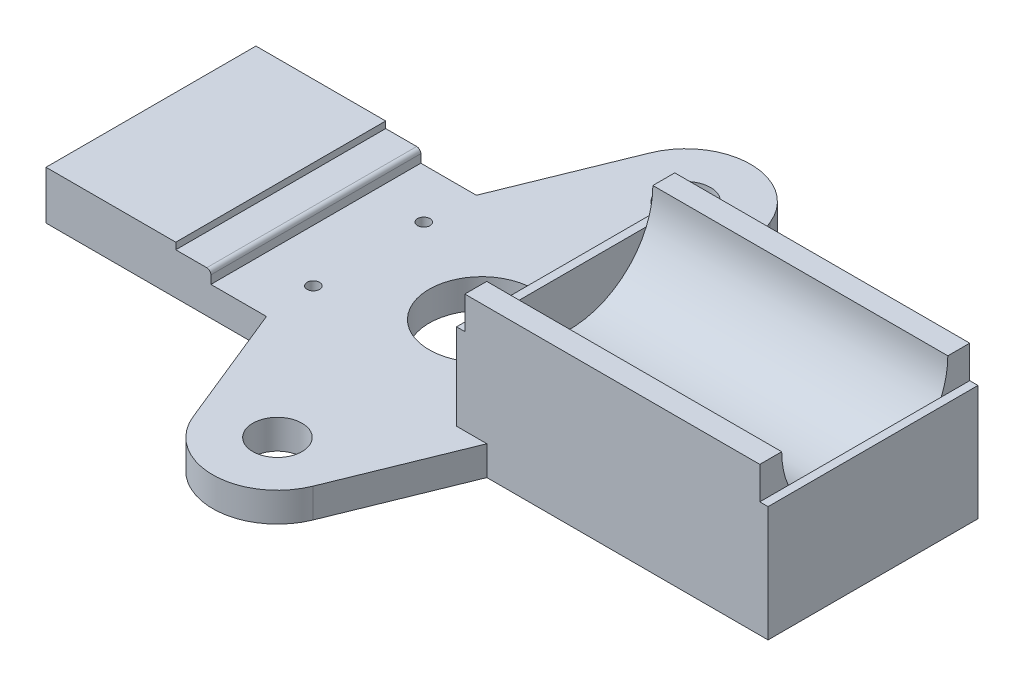
ISO-10303-21;
HEADER;
FILE_DESCRIPTION(('STEP AP214'),'2;1');
FILE_NAME('part.step','',(''),(''),'','','');
FILE_SCHEMA(('AUTOMOTIVE_DESIGN { 1 0 10303 214 1 1 1 1 }'));
ENDSEC;
DATA;
#1=APPLICATION_CONTEXT('core data for automotive mechanical design processes');
#2=APPLICATION_PROTOCOL_DEFINITION('international standard','automotive_design',2000,#1);
#3=PRODUCT_CONTEXT('',#1,'mechanical');
#4=PRODUCT('Part','Part','',(#3));
#5=PRODUCT_RELATED_PRODUCT_CATEGORY('part','',(#4));
#6=PRODUCT_DEFINITION_FORMATION('','',#4);
#7=PRODUCT_DEFINITION_CONTEXT('part definition',#1,'design');
#8=PRODUCT_DEFINITION('design','',#6,#7);
#9=PRODUCT_DEFINITION_SHAPE('','',#8);
#10=(LENGTH_UNIT() NAMED_UNIT(*) SI_UNIT(.MILLI.,.METRE.));
#11=(NAMED_UNIT(*) PLANE_ANGLE_UNIT() SI_UNIT($,.RADIAN.));
#12=(NAMED_UNIT(*) SI_UNIT($,.STERADIAN.) SOLID_ANGLE_UNIT());
#13=UNCERTAINTY_MEASURE_WITH_UNIT(LENGTH_MEASURE(1.E-05),#10,'distance_accuracy_value','');
#14=(GEOMETRIC_REPRESENTATION_CONTEXT(3) GLOBAL_UNCERTAINTY_ASSIGNED_CONTEXT((#13)) GLOBAL_UNIT_ASSIGNED_CONTEXT((#10,
#11,#12)) REPRESENTATION_CONTEXT('',''));
#15=CARTESIAN_POINT('',(0.,0.,0.));
#16=DIRECTION('',(0.,0.,1.));
#17=DIRECTION('',(1.,0.,0.));
#18=AXIS2_PLACEMENT_3D('',#15,#16,#17);
#19=CARTESIAN_POINT('',(-86.36,12.7,25.4));
#20=DIRECTION('',(0.,0.,-1.));
#21=DIRECTION('',(-1.,0.,0.));
#22=AXIS2_PLACEMENT_3D('',#19,#20,#21);
#23=PLANE('',#22);
#24=DIRECTION('',(0.,-1.,0.));
#25=VECTOR('',#24,1.);
#26=CARTESIAN_POINT('',(-33.02,73.5849851940271,25.4));
#27=LINE('',#26,#25);
#28=CARTESIAN_POINT('',(-33.02,7.1,25.4));
#29=VERTEX_POINT('',#28);
#30=CARTESIAN_POINT('',(-33.02,0.,25.4));
#31=VERTEX_POINT('',#30);
#32=EDGE_CURVE('E249',#29,#31,#27,.T.);
#33=ORIENTED_EDGE('',*,*,#32,.F.);
#34=DIRECTION('',(1.,0.,0.));
#35=VECTOR('',#34,1.);
#36=CARTESIAN_POINT('',(-46.45999982,7.1,25.4));
#37=LINE('',#36,#35);
#38=CARTESIAN_POINT('',(-46.45999982,7.1,25.4));
#39=VERTEX_POINT('',#38);
#40=EDGE_CURVE('E294',#39,#29,#37,.T.);
#41=ORIENTED_EDGE('',*,*,#40,.F.);
#42=DIRECTION('',(0.,-1.,0.));
#43=VECTOR('',#42,1.);
#44=CARTESIAN_POINT('',(-46.45999982,10.1,25.4));
#45=LINE('',#44,#43);
#46=CARTESIAN_POINT('',(-46.45999982,9.1,25.4));
#47=VERTEX_POINT('',#46);
#48=EDGE_CURVE('E314',#47,#39,#45,.T.);
#49=ORIENTED_EDGE('',*,*,#48,.F.);
#50=CARTESIAN_POINT('',(-47.45999982,9.1,25.4));
#51=DIRECTION('',(0.,0.,-1.));
#52=DIRECTION('',(-1.,0.,0.));
#53=AXIS2_PLACEMENT_3D('',#50,#51,#52);
#54=CIRCLE('',#53,1.);
#55=CARTESIAN_POINT('',(-47.45999982,10.1,25.4));
#56=VERTEX_POINT('',#55);
#57=EDGE_CURVE('E430',#47,#56,#54,.F.);
#58=ORIENTED_EDGE('',*,*,#57,.T.);
#59=DIRECTION('',(1.,0.,0.));
#60=VECTOR('',#59,1.);
#61=CARTESIAN_POINT('',(-54.96,10.1,25.4));
#62=LINE('',#61,#60);
#63=CARTESIAN_POINT('',(-54.96,10.1,25.4));
#64=VERTEX_POINT('',#63);
#65=EDGE_CURVE('E311',#64,#56,#62,.T.);
#66=ORIENTED_EDGE('',*,*,#65,.F.);
#67=DIRECTION('',(0.,-1.,0.));
#68=VECTOR('',#67,1.);
#69=CARTESIAN_POINT('',(-54.96,11.7,25.4));
#70=LINE('',#69,#68);
#71=CARTESIAN_POINT('',(-54.96,11.7,25.4));
#72=VERTEX_POINT('',#71);
#73=EDGE_CURVE('E308',#72,#64,#70,.T.);
#74=ORIENTED_EDGE('',*,*,#73,.F.);
#75=DIRECTION('',(1.,0.,0.));
#76=VECTOR('',#75,1.);
#77=CARTESIAN_POINT('',(-86.36,11.7,25.4));
#78=LINE('',#77,#76);
#79=CARTESIAN_POINT('',(-86.36,11.7,25.4));
#80=VERTEX_POINT('',#79);
#81=EDGE_CURVE('E289',#80,#72,#78,.T.);
#82=ORIENTED_EDGE('',*,*,#81,.F.);
#83=DIRECTION('',(0.,-1.,0.));
#84=VECTOR('',#83,1.);
#85=CARTESIAN_POINT('',(-86.36,12.7,25.4));
#86=LINE('',#85,#84);
#87=CARTESIAN_POINT('',(-86.36,0.,25.4));
#88=VERTEX_POINT('',#87);
#89=EDGE_CURVE('E416',#80,#88,#86,.T.);
#90=ORIENTED_EDGE('',*,*,#89,.T.);
#91=DIRECTION('',(1.,0.,0.));
#92=VECTOR('',#91,1.);
#93=CARTESIAN_POINT('',(-86.36,0.,25.4));
#94=LINE('',#93,#92);
#95=EDGE_CURVE('E411',#88,#31,#94,.T.);
#96=ORIENTED_EDGE('',*,*,#95,.T.);
#97=EDGE_LOOP('',(#33,#41,#49,#58,#66,#74,#82,#90,#96));
#98=FACE_BOUND('',#97,.T.);
#99=ADVANCED_FACE('F37',(#98),#23,.F.);
#100=CARTESIAN_POINT('',(-86.36,12.7,-25.4));
#101=DIRECTION('',(0.,0.,1.));
#102=DIRECTION('',(1.,0.,0.));
#103=AXIS2_PLACEMENT_3D('',#100,#101,#102);
#104=PLANE('',#103);
#105=DIRECTION('',(0.,-1.,0.));
#106=VECTOR('',#105,1.);
#107=CARTESIAN_POINT('',(20.32,73.5849851940271,-25.4));
#108=LINE('',#107,#106);
#109=CARTESIAN_POINT('',(20.32,7.1,-25.4));
#110=VERTEX_POINT('',#109);
#111=CARTESIAN_POINT('',(20.32,0.,-25.4));
#112=VERTEX_POINT('',#111);
#113=EDGE_CURVE('E263',#110,#112,#108,.T.);
#114=ORIENTED_EDGE('',*,*,#113,.F.);
#115=DIRECTION('',(-1.,0.,0.));
#116=VECTOR('',#115,1.);
#117=CARTESIAN_POINT('',(20.32,7.1,-25.4));
#118=LINE('',#117,#116);
#119=CARTESIAN_POINT('',(12.986,7.1,-25.4));
#120=VERTEX_POINT('',#119);
#121=EDGE_CURVE('E267',#110,#120,#118,.T.);
#122=ORIENTED_EDGE('',*,*,#121,.T.);
#123=DIRECTION('',(0.,-1.,0.));
#124=VECTOR('',#123,1.);
#125=CARTESIAN_POINT('',(12.986,12.7,-25.4));
#126=LINE('',#125,#124);
#127=CARTESIAN_POINT('',(12.986,27.94,-25.4));
#128=VERTEX_POINT('',#127);
#129=EDGE_CURVE('E330',#128,#120,#126,.T.);
#130=ORIENTED_EDGE('',*,*,#129,.F.);
#131=DIRECTION('',(1.,0.,0.));
#132=VECTOR('',#131,1.);
#133=CARTESIAN_POINT('',(12.986,27.94,-25.4));
#134=LINE('',#133,#132);
#135=CARTESIAN_POINT('',(14.986,27.94,-25.4));
#136=VERTEX_POINT('',#135);
#137=EDGE_CURVE('E338',#128,#136,#134,.T.);
#138=ORIENTED_EDGE('',*,*,#137,.T.);
#139=DIRECTION('',(0.,1.,0.));
#140=VECTOR('',#139,1.);
#141=CARTESIAN_POINT('',(14.986,35.8,-25.4));
#142=LINE('',#141,#140);
#143=CARTESIAN_POINT('',(14.986,35.8,-25.4));
#144=VERTEX_POINT('',#143);
#145=EDGE_CURVE('E367',#136,#144,#142,.T.);
#146=ORIENTED_EDGE('',*,*,#145,.T.);
#147=DIRECTION('',(1.,0.,0.));
#148=VECTOR('',#147,1.);
#149=CARTESIAN_POINT('',(14.986,35.8,-25.4));
#150=LINE('',#149,#148);
#151=CARTESIAN_POINT('',(86.36,35.8,-25.4));
#152=VERTEX_POINT('',#151);
#153=EDGE_CURVE('E384',#144,#152,#150,.T.);
#154=ORIENTED_EDGE('',*,*,#153,.T.);
#155=DIRECTION('',(0.,-1.,0.));
#156=VECTOR('',#155,1.);
#157=CARTESIAN_POINT('',(86.36,12.7,-25.4));
#158=LINE('',#157,#156);
#159=CARTESIAN_POINT('',(86.36,27.94,-25.4));
#160=VERTEX_POINT('',#159);
#161=EDGE_CURVE('E421',#152,#160,#158,.T.);
#162=ORIENTED_EDGE('',*,*,#161,.T.);
#163=DIRECTION('',(-1.,0.,0.));
#164=VECTOR('',#163,1.);
#165=CARTESIAN_POINT('',(88.36,27.94,-25.4));
#166=LINE('',#165,#164);
#167=CARTESIAN_POINT('',(88.36,27.94,-25.4));
#168=VERTEX_POINT('',#167);
#169=EDGE_CURVE('E363',#168,#160,#166,.T.);
#170=ORIENTED_EDGE('',*,*,#169,.F.);
#171=DIRECTION('',(0.,1.,0.));
#172=VECTOR('',#171,1.);
#173=CARTESIAN_POINT('',(88.36,0.,-25.4));
#174=LINE('',#173,#172);
#175=CARTESIAN_POINT('',(88.36,0.,-25.4));
#176=VERTEX_POINT('',#175);
#177=EDGE_CURVE('E353',#176,#168,#174,.T.);
#178=ORIENTED_EDGE('',*,*,#177,.F.);
#179=DIRECTION('',(-1.,0.,0.));
#180=VECTOR('',#179,1.);
#181=CARTESIAN_POINT('',(-86.36,0.,-25.4));
#182=LINE('',#181,#180);
#183=EDGE_CURVE('E405',#176,#112,#182,.T.);
#184=ORIENTED_EDGE('',*,*,#183,.T.);
#185=EDGE_LOOP('',(#114,#122,#130,#138,#146,#154,#162,#170,#178,#184));
#186=FACE_BOUND('',#185,.T.);
#187=ADVANCED_FACE('F481',(#186),#104,.F.);
#188=CARTESIAN_POINT('',(14.986,35.8,0.));
#189=DIRECTION('',(-1.,0.,0.));
#190=DIRECTION('',(0.,0.,1.));
#191=AXIS2_PLACEMENT_3D('',#188,#189,#190);
#192=PLANE('',#191);
#193=ORIENTED_EDGE('',*,*,#145,.F.);
#194=DIRECTION('',(0.,0.,1.));
#195=VECTOR('',#194,1.);
#196=CARTESIAN_POINT('',(14.986,27.94,0.));
#197=LINE('',#196,#195);
#198=CARTESIAN_POINT('',(14.986,27.94,-18.4994702626859));
#199=VERTEX_POINT('',#198);
#200=EDGE_CURVE('E424',#136,#199,#197,.T.);
#201=ORIENTED_EDGE('',*,*,#200,.T.);
#202=CARTESIAN_POINT('',(14.986,35.8,0.));
#203=DIRECTION('',(-1.,0.,0.));
#204=DIRECTION('',(0.,0.,1.));
#205=AXIS2_PLACEMENT_3D('',#202,#203,#204);
#206=CIRCLE('',#205,20.1);
#207=CARTESIAN_POINT('',(14.986,35.8,-20.1));
#208=VERTEX_POINT('',#207);
#209=EDGE_CURVE('E374',#208,#199,#206,.T.);
#210=ORIENTED_EDGE('',*,*,#209,.F.);
#211=DIRECTION('',(0.,0.,1.));
#212=VECTOR('',#211,1.);
#213=CARTESIAN_POINT('',(14.986,35.8,-25.4));
#214=LINE('',#213,#212);
#215=EDGE_CURVE('E369',#144,#208,#214,.T.);
#216=ORIENTED_EDGE('',*,*,#215,.F.);
#217=EDGE_LOOP('',(#193,#201,#210,#216));
#218=FACE_BOUND('',#217,.T.);
#219=ADVANCED_FACE('F547',(#218),#192,.T.);
#220=CARTESIAN_POINT('',(14.986,27.94,18.4994702626859));
#221=VERTEX_POINT('',#220);
#222=CARTESIAN_POINT('',(14.986,35.8,20.1));
#223=VERTEX_POINT('',#222);
#224=EDGE_CURVE('E373',#221,#223,#206,.T.);
#225=ORIENTED_EDGE('',*,*,#224,.F.);
#226=DIRECTION('',(0.,0.,-1.));
#227=VECTOR('',#226,1.);
#228=CARTESIAN_POINT('',(14.986,27.94,-25.4));
#229=LINE('',#228,#227);
#230=CARTESIAN_POINT('',(14.986,27.94,25.4));
#231=VERTEX_POINT('',#230);
#232=EDGE_CURVE('E334',#231,#221,#229,.T.);
#233=ORIENTED_EDGE('',*,*,#232,.F.);
#234=DIRECTION('',(0.,-1.,0.));
#235=VECTOR('',#234,1.);
#236=CARTESIAN_POINT('',(14.986,12.7,25.4));
#237=LINE('',#236,#235);
#238=CARTESIAN_POINT('',(14.986,35.8,25.4));
#239=VERTEX_POINT('',#238);
#240=EDGE_CURVE('E381',#239,#231,#237,.T.);
#241=ORIENTED_EDGE('',*,*,#240,.F.);
#242=DIRECTION('',(0.,0.,1.));
#243=VECTOR('',#242,1.);
#244=CARTESIAN_POINT('',(14.986,35.8,25.4));
#245=LINE('',#244,#243);
#246=EDGE_CURVE('E377',#223,#239,#245,.T.);
#247=ORIENTED_EDGE('',*,*,#246,.F.);
#248=EDGE_LOOP('',(#225,#233,#241,#247));
#249=FACE_BOUND('',#248,.T.);
#250=ADVANCED_FACE('F555',(#249),#192,.T.);
#251=CARTESIAN_POINT('',(86.36,12.7,-25.4));
#252=DIRECTION('',(-1.,0.,0.));
#253=DIRECTION('',(0.,0.,1.));
#254=AXIS2_PLACEMENT_3D('',#251,#252,#253);
#255=PLANE('',#254);
#256=DIRECTION('',(0.,0.,1.));
#257=VECTOR('',#256,1.);
#258=CARTESIAN_POINT('',(86.36,27.94,25.4));
#259=LINE('',#258,#257);
#260=CARTESIAN_POINT('',(86.36,27.94,-18.4994702626859));
#261=VERTEX_POINT('',#260);
#262=EDGE_CURVE('E350',#160,#261,#259,.T.);
#263=ORIENTED_EDGE('',*,*,#262,.F.);
#264=ORIENTED_EDGE('',*,*,#161,.F.);
#265=DIRECTION('',(0.,0.,1.));
#266=VECTOR('',#265,1.);
#267=CARTESIAN_POINT('',(86.36,35.8,-25.4));
#268=LINE('',#267,#266);
#269=CARTESIAN_POINT('',(86.36,35.8,-20.1));
#270=VERTEX_POINT('',#269);
#271=EDGE_CURVE('E366',#152,#270,#268,.T.);
#272=ORIENTED_EDGE('',*,*,#271,.T.);
#273=CARTESIAN_POINT('',(86.36,35.8,0.));
#274=DIRECTION('',(-1.,0.,0.));
#275=DIRECTION('',(0.,0.,1.));
#276=AXIS2_PLACEMENT_3D('',#273,#274,#275);
#277=CIRCLE('',#276,20.1);
#278=EDGE_CURVE('E388',#270,#261,#277,.T.);
#279=ORIENTED_EDGE('',*,*,#278,.T.);
#280=EDGE_LOOP('',(#263,#264,#272,#279));
#281=FACE_BOUND('',#280,.T.);
#282=ADVANCED_FACE('F553',(#281),#255,.F.);
#283=CARTESIAN_POINT('',(86.36,27.94,18.4994702626859));
#284=VERTEX_POINT('',#283);
#285=CARTESIAN_POINT('',(86.36,27.94,25.4));
#286=VERTEX_POINT('',#285);
#287=EDGE_CURVE('E360',#284,#286,#259,.T.);
#288=ORIENTED_EDGE('',*,*,#287,.F.);
#289=CARTESIAN_POINT('',(86.36,35.8,20.1));
#290=VERTEX_POINT('',#289);
#291=EDGE_CURVE('E387',#284,#290,#277,.T.);
#292=ORIENTED_EDGE('',*,*,#291,.T.);
#293=DIRECTION('',(0.,0.,1.));
#294=VECTOR('',#293,1.);
#295=CARTESIAN_POINT('',(86.36,35.8,25.4));
#296=LINE('',#295,#294);
#297=CARTESIAN_POINT('',(86.36,35.8,25.4));
#298=VERTEX_POINT('',#297);
#299=EDGE_CURVE('E370',#290,#298,#296,.T.);
#300=ORIENTED_EDGE('',*,*,#299,.T.);
#301=DIRECTION('',(0.,-1.,0.));
#302=VECTOR('',#301,1.);
#303=CARTESIAN_POINT('',(86.36,12.7,25.4));
#304=LINE('',#303,#302);
#305=EDGE_CURVE('E414',#298,#286,#304,.T.);
#306=ORIENTED_EDGE('',*,*,#305,.T.);
#307=EDGE_LOOP('',(#288,#292,#300,#306));
#308=FACE_BOUND('',#307,.T.);
#309=ADVANCED_FACE('F552',(#308),#255,.F.);
#310=DIRECTION('',(1.,0.,0.));
#311=VECTOR('',#310,1.);
#312=CARTESIAN_POINT('',(-46.45999982,7.1,-25.4));
#313=LINE('',#312,#311);
#314=CARTESIAN_POINT('',(-46.45999982,7.1,-25.4));
#315=VERTEX_POINT('',#314);
#316=CARTESIAN_POINT('',(-33.02,7.1,-25.4));
#317=VERTEX_POINT('',#316);
#318=EDGE_CURVE('E302',#315,#317,#313,.T.);
#319=ORIENTED_EDGE('',*,*,#318,.T.);
#320=DIRECTION('',(0.,-1.,0.));
#321=VECTOR('',#320,1.);
#322=CARTESIAN_POINT('',(-33.02,73.5849851940271,-25.4));
#323=LINE('',#322,#321);
#324=CARTESIAN_POINT('',(-33.02,0.,-25.4));
#325=VERTEX_POINT('',#324);
#326=EDGE_CURVE('E272',#317,#325,#323,.T.);
#327=ORIENTED_EDGE('',*,*,#326,.T.);
#328=CARTESIAN_POINT('',(-86.36,0.,-25.4));
#329=VERTEX_POINT('',#328);
#330=EDGE_CURVE('E397',#325,#329,#182,.T.);
#331=ORIENTED_EDGE('',*,*,#330,.T.);
#332=DIRECTION('',(0.,-1.,0.));
#333=VECTOR('',#332,1.);
#334=CARTESIAN_POINT('',(-86.36,12.7,-25.4));
#335=LINE('',#334,#333);
#336=CARTESIAN_POINT('',(-86.36,11.7,-25.4));
#337=VERTEX_POINT('',#336);
#338=EDGE_CURVE('E418',#337,#329,#335,.T.);
#339=ORIENTED_EDGE('',*,*,#338,.F.);
#340=DIRECTION('',(1.,0.,0.));
#341=VECTOR('',#340,1.);
#342=CARTESIAN_POINT('',(-86.36,11.7,-25.4));
#343=LINE('',#342,#341);
#344=CARTESIAN_POINT('',(-54.96,11.7,-25.4));
#345=VERTEX_POINT('',#344);
#346=EDGE_CURVE('E290',#337,#345,#343,.T.);
#347=ORIENTED_EDGE('',*,*,#346,.T.);
#348=DIRECTION('',(0.,-1.,0.));
#349=VECTOR('',#348,1.);
#350=CARTESIAN_POINT('',(-54.96,11.7,-25.4));
#351=LINE('',#350,#349);
#352=CARTESIAN_POINT('',(-54.96,10.1,-25.4));
#353=VERTEX_POINT('',#352);
#354=EDGE_CURVE('E293',#345,#353,#351,.T.);
#355=ORIENTED_EDGE('',*,*,#354,.T.);
#356=DIRECTION('',(1.,0.,0.));
#357=VECTOR('',#356,1.);
#358=CARTESIAN_POINT('',(-54.96,10.1,-25.4));
#359=LINE('',#358,#357);
#360=CARTESIAN_POINT('',(-47.45999982,10.1,-25.4));
#361=VERTEX_POINT('',#360);
#362=EDGE_CURVE('E297',#353,#361,#359,.T.);
#363=ORIENTED_EDGE('',*,*,#362,.T.);
#364=CARTESIAN_POINT('',(-47.45999982,9.1,-25.4));
#365=DIRECTION('',(0.,0.,1.));
#366=DIRECTION('',(1.,0.,0.));
#367=AXIS2_PLACEMENT_3D('',#364,#365,#366);
#368=CIRCLE('',#367,1.);
#369=CARTESIAN_POINT('',(-46.45999982,9.1,-25.4));
#370=VERTEX_POINT('',#369);
#371=EDGE_CURVE('E41',#361,#370,#368,.F.);
#372=ORIENTED_EDGE('',*,*,#371,.T.);
#373=DIRECTION('',(0.,-1.,0.));
#374=VECTOR('',#373,1.);
#375=CARTESIAN_POINT('',(-46.45999982,10.1,-25.4));
#376=LINE('',#375,#374);
#377=EDGE_CURVE('E300',#370,#315,#376,.T.);
#378=ORIENTED_EDGE('',*,*,#377,.T.);
#379=EDGE_LOOP('',(#319,#327,#331,#339,#347,#355,#363,#372,#378));
#380=FACE_BOUND('',#379,.T.);
#381=ADVANCED_FACE('F438',(#380),#104,.F.);
#382=CARTESIAN_POINT('',(-86.36,12.7,-25.4));
#383=DIRECTION('',(1.,0.,0.));
#384=DIRECTION('',(0.,0.,-1.));
#385=AXIS2_PLACEMENT_3D('',#382,#383,#384);
#386=PLANE('',#385);
#387=ORIENTED_EDGE('',*,*,#89,.F.);
#388=DIRECTION('',(0.,0.,1.));
#389=VECTOR('',#388,1.);
#390=CARTESIAN_POINT('',(-86.36,11.7,-25.4));
#391=LINE('',#390,#389);
#392=EDGE_CURVE('E305',#337,#80,#391,.T.);
#393=ORIENTED_EDGE('',*,*,#392,.F.);
#394=ORIENTED_EDGE('',*,*,#338,.T.);
#395=DIRECTION('',(0.,0.,1.));
#396=VECTOR('',#395,1.);
#397=CARTESIAN_POINT('',(-86.36,0.,-25.4));
#398=LINE('',#397,#396);
#399=EDGE_CURVE('E408',#329,#88,#398,.T.);
#400=ORIENTED_EDGE('',*,*,#399,.T.);
#401=EDGE_LOOP('',(#387,#393,#394,#400));
#402=FACE_BOUND('',#401,.T.);
#403=ADVANCED_FACE('F460',(#402),#386,.F.);
#404=DIRECTION('',(0.,1.,0.));
#405=VECTOR('',#404,1.);
#406=CARTESIAN_POINT('',(12.986,12.7,25.4));
#407=LINE('',#406,#405);
#408=CARTESIAN_POINT('',(12.986,7.1,25.4));
#409=VERTEX_POINT('',#408);
#410=CARTESIAN_POINT('',(12.986,27.94,25.4));
#411=VERTEX_POINT('',#410);
#412=EDGE_CURVE('E333',#409,#411,#407,.T.);
#413=ORIENTED_EDGE('',*,*,#412,.F.);
#414=DIRECTION('',(1.,0.,0.));
#415=VECTOR('',#414,1.);
#416=CARTESIAN_POINT('',(20.32,7.1,25.4));
#417=LINE('',#416,#415);
#418=CARTESIAN_POINT('',(20.32,7.1,25.4));
#419=VERTEX_POINT('',#418);
#420=EDGE_CURVE('E11',#409,#419,#417,.T.);
#421=ORIENTED_EDGE('',*,*,#420,.T.);
#422=DIRECTION('',(0.,-1.,0.));
#423=VECTOR('',#422,1.);
#424=CARTESIAN_POINT('',(20.32,73.5849851940271,25.4));
#425=LINE('',#424,#423);
#426=CARTESIAN_POINT('',(20.32,0.,25.4));
#427=VERTEX_POINT('',#426);
#428=EDGE_CURVE('E234',#419,#427,#425,.T.);
#429=ORIENTED_EDGE('',*,*,#428,.T.);
#430=CARTESIAN_POINT('',(88.36,0.,25.4));
#431=VERTEX_POINT('',#430);
#432=EDGE_CURVE('E233',#427,#431,#94,.T.);
#433=ORIENTED_EDGE('',*,*,#432,.T.);
#434=DIRECTION('',(0.,-1.,0.));
#435=VECTOR('',#434,1.);
#436=CARTESIAN_POINT('',(88.36,0.,25.4));
#437=LINE('',#436,#435);
#438=CARTESIAN_POINT('',(88.36,27.94,25.4));
#439=VERTEX_POINT('',#438);
#440=EDGE_CURVE('E346',#439,#431,#437,.T.);
#441=ORIENTED_EDGE('',*,*,#440,.F.);
#442=DIRECTION('',(-1.,0.,0.));
#443=VECTOR('',#442,1.);
#444=CARTESIAN_POINT('',(88.36,27.94,25.4));
#445=LINE('',#444,#443);
#446=EDGE_CURVE('E357',#439,#286,#445,.T.);
#447=ORIENTED_EDGE('',*,*,#446,.T.);
#448=ORIENTED_EDGE('',*,*,#305,.F.);
#449=DIRECTION('',(1.,0.,0.));
#450=VECTOR('',#449,1.);
#451=CARTESIAN_POINT('',(14.986,35.8,25.4));
#452=LINE('',#451,#450);
#453=EDGE_CURVE('E394',#239,#298,#452,.T.);
#454=ORIENTED_EDGE('',*,*,#453,.F.);
#455=ORIENTED_EDGE('',*,*,#240,.T.);
#456=DIRECTION('',(1.,0.,0.));
#457=VECTOR('',#456,1.);
#458=CARTESIAN_POINT('',(12.986,27.94,25.4));
#459=LINE('',#458,#457);
#460=EDGE_CURVE('E343',#411,#231,#459,.T.);
#461=ORIENTED_EDGE('',*,*,#460,.F.);
#462=EDGE_LOOP('',(#413,#421,#429,#433,#441,#447,#448,#454,#455,#461));
#463=FACE_BOUND('',#462,.T.);
#464=ADVANCED_FACE('F492',(#463),#23,.F.);
#465=CARTESIAN_POINT('',(0.,0.,0.));
#466=DIRECTION('',(0.,1.,0.));
#467=DIRECTION('',(0.,0.,1.));
#468=AXIS2_PLACEMENT_3D('',#465,#466,#467);
#469=PLANE('',#468);
#470=CARTESIAN_POINT('',(-33.75999982,0.,-13.41));
#471=DIRECTION('',(0.,1.,0.));
#472=DIRECTION('',(0.,0.,1.));
#473=AXIS2_PLACEMENT_3D('',#470,#471,#472);
#474=CIRCLE('',#473,1.5);
#475=CARTESIAN_POINT('',(-33.75999982,0.,-11.91));
#476=VERTEX_POINT('',#475);
#477=EDGE_CURVE('E499',#476,#476,#474,.F.);
#478=ORIENTED_EDGE('',*,*,#477,.F.);
#479=EDGE_LOOP('',(#478));
#480=FACE_BOUND('',#479,.T.);
#481=CARTESIAN_POINT('',(-33.75999982,0.,13.31));
#482=DIRECTION('',(0.,1.,0.));
#483=DIRECTION('',(0.,0.,1.));
#484=AXIS2_PLACEMENT_3D('',#481,#482,#483);
#485=CIRCLE('',#484,1.5);
#486=CARTESIAN_POINT('',(-33.75999982,0.,14.81));
#487=VERTEX_POINT('',#486);
#488=EDGE_CURVE('E504',#487,#487,#485,.F.);
#489=ORIENTED_EDGE('',*,*,#488,.F.);
#490=EDGE_LOOP('',(#489));
#491=FACE_BOUND('',#490,.T.);
#492=CARTESIAN_POINT('',(-6.35,0.,0.));
#493=DIRECTION('',(0.,-1.,0.));
#494=DIRECTION('',(0.,0.,-1.));
#495=AXIS2_PLACEMENT_3D('',#492,#493,#494);
#496=CIRCLE('',#495,12.7);
#497=CARTESIAN_POINT('',(-6.35,0.,-12.7));
#498=VERTEX_POINT('',#497);
#499=EDGE_CURVE('E283',#498,#498,#496,.T.);
#500=ORIENTED_EDGE('',*,*,#499,.F.);
#501=EDGE_LOOP('',(#500));
#502=FACE_BOUND('',#501,.T.);
#503=ORIENTED_EDGE('',*,*,#183,.F.);
#504=DIRECTION('',(0.,0.,-1.));
#505=VECTOR('',#504,1.);
#506=CARTESIAN_POINT('',(88.36,0.,25.4));
#507=LINE('',#506,#505);
#508=EDGE_CURVE('E349',#431,#176,#507,.T.);
#509=ORIENTED_EDGE('',*,*,#508,.F.);
#510=ORIENTED_EDGE('',*,*,#432,.F.);
#511=DIRECTION('',(0.376231747812622,0.,-0.926525591625973));
#512=VECTOR('',#511,1.);
#513=CARTESIAN_POINT('',(8.17503051684938,0.,55.3087599626488));
#514=LINE('',#513,#512);
#515=CARTESIAN_POINT('',(8.17503051684938,0.,55.3087599626488));
#516=VERTEX_POINT('',#515);
#517=EDGE_CURVE('E53',#516,#427,#514,.T.);
#518=ORIENTED_EDGE('',*,*,#517,.F.);
#519=CARTESIAN_POINT('',(-6.35,0.,49.41062));
#520=DIRECTION('',(0.,1.,0.));
#521=DIRECTION('',(0.,0.,1.));
#522=AXIS2_PLACEMENT_3D('',#519,#520,#521);
#523=CIRCLE('',#522,15.67688);
#524=CARTESIAN_POINT('',(-20.8750305168494,0.,55.3087599626488));
#525=VERTEX_POINT('',#524);
#526=EDGE_CURVE('E231',#525,#516,#523,.T.);
#527=ORIENTED_EDGE('',*,*,#526,.F.);
#528=DIRECTION('',(0.376231747812622,0.,0.926525591625973));
#529=VECTOR('',#528,1.);
#530=CARTESIAN_POINT('',(-33.02,0.,25.4));
#531=LINE('',#530,#529);
#532=EDGE_CURVE('E247',#31,#525,#531,.T.);
#533=ORIENTED_EDGE('',*,*,#532,.F.);
#534=ORIENTED_EDGE('',*,*,#95,.F.);
#535=ORIENTED_EDGE('',*,*,#399,.F.);
#536=ORIENTED_EDGE('',*,*,#330,.F.);
#537=DIRECTION('',(-0.376231747812622,0.,0.926525591625973));
#538=VECTOR('',#537,1.);
#539=CARTESIAN_POINT('',(-33.02,0.,-25.4));
#540=LINE('',#539,#538);
#541=CARTESIAN_POINT('',(-20.8750305168494,0.,-55.3087599626488));
#542=VERTEX_POINT('',#541);
#543=EDGE_CURVE('E61',#542,#325,#540,.T.);
#544=ORIENTED_EDGE('',*,*,#543,.F.);
#545=CARTESIAN_POINT('',(-6.35,0.,-49.41062));
#546=DIRECTION('',(0.,1.,0.));
#547=DIRECTION('',(0.,0.,-1.));
#548=AXIS2_PLACEMENT_3D('',#545,#546,#547);
#549=CIRCLE('',#548,15.67688);
#550=CARTESIAN_POINT('',(8.17503051684938,0.,-55.3087599626488));
#551=VERTEX_POINT('',#550);
#552=EDGE_CURVE('E254',#551,#542,#549,.T.);
#553=ORIENTED_EDGE('',*,*,#552,.F.);
#554=DIRECTION('',(-0.376231747812622,0.,-0.926525591625973));
#555=VECTOR('',#554,1.);
#556=CARTESIAN_POINT('',(8.17503051684938,0.,-55.3087599626488));
#557=LINE('',#556,#555);
#558=EDGE_CURVE('E259',#112,#551,#557,.T.);
#559=ORIENTED_EDGE('',*,*,#558,.F.);
#560=EDGE_LOOP('',(#503,#509,#510,#518,#527,#533,#534,#535,#536,#544,#553,#559));
#561=FACE_BOUND('',#560,.T.);
#562=CARTESIAN_POINT('',(-6.35,0.,-49.41062));
#563=DIRECTION('',(0.,1.,0.));
#564=DIRECTION('',(0.,0.,1.));
#565=AXIS2_PLACEMENT_3D('',#562,#563,#564);
#566=CIRCLE('',#565,5.9563);
#567=CARTESIAN_POINT('',(-6.35,0.,-43.45432));
#568=VERTEX_POINT('',#567);
#569=EDGE_CURVE('E264',#568,#568,#566,.T.);
#570=ORIENTED_EDGE('',*,*,#569,.T.);
#571=EDGE_LOOP('',(#570));
#572=FACE_BOUND('',#571,.T.);
#573=CARTESIAN_POINT('',(-6.35,0.,49.41062));
#574=DIRECTION('',(0.,1.,0.));
#575=DIRECTION('',(0.,0.,-1.));
#576=AXIS2_PLACEMENT_3D('',#573,#574,#575);
#577=CIRCLE('',#576,5.9563);
#578=CARTESIAN_POINT('',(-6.35,0.,43.45432));
#579=VERTEX_POINT('',#578);
#580=EDGE_CURVE('E245',#579,#579,#577,.T.);
#581=ORIENTED_EDGE('',*,*,#580,.T.);
#582=EDGE_LOOP('',(#581));
#583=FACE_BOUND('',#582,.T.);
#584=ADVANCED_FACE('F228',(#480,#491,#502,#561,#572,#583),#469,.F.);
#585=CARTESIAN_POINT('',(14.986,35.8,25.4));
#586=DIRECTION('',(0.,1.,0.));
#587=DIRECTION('',(0.,0.,1.));
#588=AXIS2_PLACEMENT_3D('',#585,#586,#587);
#589=PLANE('',#588);
#590=ORIENTED_EDGE('',*,*,#299,.F.);
#591=DIRECTION('',(1.,0.,0.));
#592=VECTOR('',#591,1.);
#593=CARTESIAN_POINT('',(14.986,35.8,20.1));
#594=LINE('',#593,#592);
#595=EDGE_CURVE('E398',#223,#290,#594,.T.);
#596=ORIENTED_EDGE('',*,*,#595,.F.);
#597=ORIENTED_EDGE('',*,*,#246,.T.);
#598=ORIENTED_EDGE('',*,*,#453,.T.);
#599=EDGE_LOOP('',(#590,#596,#597,#598));
#600=FACE_BOUND('',#599,.T.);
#601=ADVANCED_FACE('F529',(#600),#589,.T.);
#602=CARTESIAN_POINT('',(14.986,35.8,0.));
#603=DIRECTION('',(1.,0.,0.));
#604=DIRECTION('',(0.,0.,-1.));
#605=AXIS2_PLACEMENT_3D('',#602,#603,#604);
#606=CYLINDRICAL_SURFACE('',#605,20.1);
#607=ORIENTED_EDGE('',*,*,#278,.F.);
#608=DIRECTION('',(1.,0.,0.));
#609=VECTOR('',#608,1.);
#610=CARTESIAN_POINT('',(14.986,35.8,-20.1));
#611=LINE('',#610,#609);
#612=EDGE_CURVE('E401',#208,#270,#611,.T.);
#613=ORIENTED_EDGE('',*,*,#612,.F.);
#614=ORIENTED_EDGE('',*,*,#209,.T.);
#615=EDGE_CURVE('E378',#199,#221,#206,.T.);
#616=ORIENTED_EDGE('',*,*,#615,.T.);
#617=ORIENTED_EDGE('',*,*,#224,.T.);
#618=ORIENTED_EDGE('',*,*,#595,.T.);
#619=ORIENTED_EDGE('',*,*,#291,.F.);
#620=EDGE_CURVE('E391',#261,#284,#277,.T.);
#621=ORIENTED_EDGE('',*,*,#620,.F.);
#622=EDGE_LOOP('',(#607,#613,#614,#616,#617,#618,#619,#621));
#623=FACE_BOUND('',#622,.T.);
#624=ADVANCED_FACE('F536',(#623),#606,.F.);
#625=CARTESIAN_POINT('',(14.986,35.8,-25.4));
#626=DIRECTION('',(0.,1.,0.));
#627=DIRECTION('',(0.,0.,1.));
#628=AXIS2_PLACEMENT_3D('',#625,#626,#627);
#629=PLANE('',#628);
#630=ORIENTED_EDGE('',*,*,#271,.F.);
#631=ORIENTED_EDGE('',*,*,#153,.F.);
#632=ORIENTED_EDGE('',*,*,#215,.T.);
#633=ORIENTED_EDGE('',*,*,#612,.T.);
#634=EDGE_LOOP('',(#630,#631,#632,#633));
#635=FACE_BOUND('',#634,.T.);
#636=ADVANCED_FACE('F593',(#635),#629,.T.);
#637=CARTESIAN_POINT('',(88.36,27.94,25.4));
#638=DIRECTION('',(0.,-1.,0.));
#639=DIRECTION('',(0.,0.,-1.));
#640=AXIS2_PLACEMENT_3D('',#637,#638,#639);
#641=PLANE('',#640);
#642=ORIENTED_EDGE('',*,*,#262,.T.);
#643=EDGE_CURVE('E345',#261,#284,#259,.T.);
#644=ORIENTED_EDGE('',*,*,#643,.T.);
#645=ORIENTED_EDGE('',*,*,#287,.T.);
#646=ORIENTED_EDGE('',*,*,#446,.F.);
#647=DIRECTION('',(0.,0.,1.));
#648=VECTOR('',#647,1.);
#649=CARTESIAN_POINT('',(88.36,27.94,25.4));
#650=LINE('',#649,#648);
#651=EDGE_CURVE('E355',#168,#439,#650,.T.);
#652=ORIENTED_EDGE('',*,*,#651,.F.);
#653=ORIENTED_EDGE('',*,*,#169,.T.);
#654=EDGE_LOOP('',(#642,#644,#645,#646,#652,#653));
#655=FACE_BOUND('',#654,.T.);
#656=ADVANCED_FACE('F570',(#655),#641,.F.);
#657=CARTESIAN_POINT('',(88.36,0.,0.));
#658=DIRECTION('',(-1.,0.,0.));
#659=DIRECTION('',(0.,0.,1.));
#660=AXIS2_PLACEMENT_3D('',#657,#658,#659);
#661=PLANE('',#660);
#662=ORIENTED_EDGE('',*,*,#440,.T.);
#663=ORIENTED_EDGE('',*,*,#508,.T.);
#664=ORIENTED_EDGE('',*,*,#177,.T.);
#665=ORIENTED_EDGE('',*,*,#651,.T.);
#666=EDGE_LOOP('',(#662,#663,#664,#665));
#667=FACE_BOUND('',#666,.T.);
#668=ADVANCED_FACE('F486',(#667),#661,.F.);
#669=CARTESIAN_POINT('',(86.36,0.,0.));
#670=DIRECTION('',(-1.,0.,0.));
#671=DIRECTION('',(0.,0.,1.));
#672=AXIS2_PLACEMENT_3D('',#669,#670,#671);
#673=PLANE('',#672);
#674=ORIENTED_EDGE('',*,*,#643,.F.);
#675=ORIENTED_EDGE('',*,*,#620,.T.);
#676=EDGE_LOOP('',(#674,#675));
#677=FACE_BOUND('',#676,.T.);
#678=ADVANCED_FACE('F578',(#677),#673,.T.);
#679=CARTESIAN_POINT('',(14.986,0.,0.));
#680=DIRECTION('',(1.,0.,0.));
#681=DIRECTION('',(0.,0.,-1.));
#682=AXIS2_PLACEMENT_3D('',#679,#680,#681);
#683=PLANE('',#682);
#684=EDGE_CURVE('E321',#221,#199,#229,.T.);
#685=ORIENTED_EDGE('',*,*,#684,.F.);
#686=ORIENTED_EDGE('',*,*,#615,.F.);
#687=EDGE_LOOP('',(#685,#686));
#688=FACE_BOUND('',#687,.T.);
#689=ADVANCED_FACE('F580',(#688),#683,.T.);
#690=CARTESIAN_POINT('',(12.986,27.94,-25.4));
#691=DIRECTION('',(0.,-1.,0.));
#692=DIRECTION('',(0.,0.,-1.));
#693=AXIS2_PLACEMENT_3D('',#690,#691,#692);
#694=PLANE('',#693);
#695=ORIENTED_EDGE('',*,*,#232,.T.);
#696=ORIENTED_EDGE('',*,*,#684,.T.);
#697=ORIENTED_EDGE('',*,*,#200,.F.);
#698=ORIENTED_EDGE('',*,*,#137,.F.);
#699=DIRECTION('',(0.,0.,-1.));
#700=VECTOR('',#699,1.);
#701=CARTESIAN_POINT('',(12.986,27.94,-25.4));
#702=LINE('',#701,#700);
#703=EDGE_CURVE('E336',#411,#128,#702,.T.);
#704=ORIENTED_EDGE('',*,*,#703,.F.);
#705=ORIENTED_EDGE('',*,*,#460,.T.);
#706=EDGE_LOOP('',(#695,#696,#697,#698,#704,#705));
#707=FACE_BOUND('',#706,.T.);
#708=ADVANCED_FACE('F586',(#707),#694,.F.);
#709=CARTESIAN_POINT('',(12.986,0.,0.));
#710=DIRECTION('',(1.,0.,0.));
#711=DIRECTION('',(0.,0.,-1.));
#712=AXIS2_PLACEMENT_3D('',#709,#710,#711);
#713=PLANE('',#712);
#714=ORIENTED_EDGE('',*,*,#129,.T.);
#715=DIRECTION('',(0.,0.,1.));
#716=VECTOR('',#715,1.);
#717=CARTESIAN_POINT('',(12.986,7.1,-25.4));
#718=LINE('',#717,#716);
#719=EDGE_CURVE('E318',#120,#409,#718,.T.);
#720=ORIENTED_EDGE('',*,*,#719,.T.);
#721=ORIENTED_EDGE('',*,*,#412,.T.);
#722=ORIENTED_EDGE('',*,*,#703,.T.);
#723=EDGE_LOOP('',(#714,#720,#721,#722));
#724=FACE_BOUND('',#723,.T.);
#725=ADVANCED_FACE('F516',(#724),#713,.F.);
#726=CARTESIAN_POINT('',(-46.45999982,7.1,-25.4));
#727=DIRECTION('',(0.,-1.,0.));
#728=DIRECTION('',(0.,0.,-1.));
#729=AXIS2_PLACEMENT_3D('',#726,#727,#728);
#730=PLANE('',#729);
#731=CARTESIAN_POINT('',(-33.75999982,7.1,-13.41));
#732=DIRECTION('',(0.,1.,0.));
#733=DIRECTION('',(0.,0.,1.));
#734=AXIS2_PLACEMENT_3D('',#731,#732,#733);
#735=CIRCLE('',#734,1.5);
#736=CARTESIAN_POINT('',(-33.75999982,7.1,-11.91));
#737=VERTEX_POINT('',#736);
#738=EDGE_CURVE('E503',#737,#737,#735,.T.);
#739=ORIENTED_EDGE('',*,*,#738,.F.);
#740=EDGE_LOOP('',(#739));
#741=FACE_BOUND('',#740,.T.);
#742=CARTESIAN_POINT('',(-33.75999982,7.1,13.31));
#743=DIRECTION('',(0.,1.,0.));
#744=DIRECTION('',(0.,0.,1.));
#745=AXIS2_PLACEMENT_3D('',#742,#743,#744);
#746=CIRCLE('',#745,1.5);
#747=CARTESIAN_POINT('',(-33.75999982,7.1,14.81));
#748=VERTEX_POINT('',#747);
#749=EDGE_CURVE('E500',#748,#748,#746,.T.);
#750=ORIENTED_EDGE('',*,*,#749,.F.);
#751=EDGE_LOOP('',(#750));
#752=FACE_BOUND('',#751,.T.);
#753=CARTESIAN_POINT('',(-6.35,7.1,0.));
#754=DIRECTION('',(0.,-1.,0.));
#755=DIRECTION('',(0.,0.,-1.));
#756=AXIS2_PLACEMENT_3D('',#753,#754,#755);
#757=CIRCLE('',#756,12.7);
#758=CARTESIAN_POINT('',(-6.35,7.1,-12.7));
#759=VERTEX_POINT('',#758);
#760=EDGE_CURVE('E286',#759,#759,#757,.F.);
#761=ORIENTED_EDGE('',*,*,#760,.F.);
#762=EDGE_LOOP('',(#761));
#763=FACE_BOUND('',#762,.T.);
#764=ORIENTED_EDGE('',*,*,#40,.T.);
#765=DIRECTION('',(-0.376231747812622,0.,-0.926525591625973));
#766=VECTOR('',#765,1.);
#767=CARTESIAN_POINT('',(-33.02,7.1,25.4));
#768=LINE('',#767,#766);
#769=CARTESIAN_POINT('',(-20.8750305168494,7.1,55.3087599626488));
#770=VERTEX_POINT('',#769);
#771=EDGE_CURVE('E466',#770,#29,#768,.T.);
#772=ORIENTED_EDGE('',*,*,#771,.F.);
#773=CARTESIAN_POINT('',(-6.35,7.1,49.41062));
#774=DIRECTION('',(0.,-1.,0.));
#775=DIRECTION('',(0.,0.,-1.));
#776=AXIS2_PLACEMENT_3D('',#773,#774,#775);
#777=CIRCLE('',#776,15.67688);
#778=CARTESIAN_POINT('',(8.17503051684938,7.1,55.3087599626488));
#779=VERTEX_POINT('',#778);
#780=EDGE_CURVE('E241',#779,#770,#777,.T.);
#781=ORIENTED_EDGE('',*,*,#780,.F.);
#782=DIRECTION('',(-0.376231747812622,0.,0.926525591625973));
#783=VECTOR('',#782,1.);
#784=CARTESIAN_POINT('',(8.17503051684938,7.1,55.3087599626488));
#785=LINE('',#784,#783);
#786=EDGE_CURVE('E220',#419,#779,#785,.T.);
#787=ORIENTED_EDGE('',*,*,#786,.F.);
#788=ORIENTED_EDGE('',*,*,#420,.F.);
#789=ORIENTED_EDGE('',*,*,#719,.F.);
#790=ORIENTED_EDGE('',*,*,#121,.F.);
#791=DIRECTION('',(0.376231747812622,0.,0.926525591625973));
#792=VECTOR('',#791,1.);
#793=CARTESIAN_POINT('',(8.17503051684938,7.1,-55.3087599626488));
#794=LINE('',#793,#792);
#795=CARTESIAN_POINT('',(8.17503051684938,7.1,-55.3087599626488));
#796=VERTEX_POINT('',#795);
#797=EDGE_CURVE('E269',#796,#110,#794,.T.);
#798=ORIENTED_EDGE('',*,*,#797,.F.);
#799=CARTESIAN_POINT('',(-6.35,7.1,-49.41062));
#800=DIRECTION('',(0.,-1.,0.));
#801=DIRECTION('',(0.,0.,-1.));
#802=AXIS2_PLACEMENT_3D('',#799,#800,#801);
#803=CIRCLE('',#802,15.67688);
#804=CARTESIAN_POINT('',(-20.8750305168494,7.1,-55.3087599626488));
#805=VERTEX_POINT('',#804);
#806=EDGE_CURVE('E262',#805,#796,#803,.T.);
#807=ORIENTED_EDGE('',*,*,#806,.F.);
#808=DIRECTION('',(0.376231747812622,0.,-0.926525591625973));
#809=VECTOR('',#808,1.);
#810=CARTESIAN_POINT('',(-33.02,7.1,-25.4));
#811=LINE('',#810,#809);
#812=EDGE_CURVE('E257',#317,#805,#811,.T.);
#813=ORIENTED_EDGE('',*,*,#812,.F.);
#814=ORIENTED_EDGE('',*,*,#318,.F.);
#815=DIRECTION('',(0.,0.,1.));
#816=VECTOR('',#815,1.);
#817=CARTESIAN_POINT('',(-46.45999982,7.1,-25.4));
#818=LINE('',#817,#816);
#819=EDGE_CURVE('E322',#315,#39,#818,.T.);
#820=ORIENTED_EDGE('',*,*,#819,.T.);
#821=EDGE_LOOP('',(#764,#772,#781,#787,#788,#789,#790,#798,#807,#813,#814,#820));
#822=FACE_BOUND('',#821,.T.);
#823=CARTESIAN_POINT('',(-6.35,7.1,-49.41062));
#824=DIRECTION('',(0.,-1.,0.));
#825=DIRECTION('',(0.,0.,-1.));
#826=AXIS2_PLACEMENT_3D('',#823,#824,#825);
#827=CIRCLE('',#826,5.9563);
#828=CARTESIAN_POINT('',(-6.35,7.1,-55.36692));
#829=VERTEX_POINT('',#828);
#830=EDGE_CURVE('E252',#829,#829,#827,.T.);
#831=ORIENTED_EDGE('',*,*,#830,.T.);
#832=EDGE_LOOP('',(#831));
#833=FACE_BOUND('',#832,.T.);
#834=CARTESIAN_POINT('',(-6.35,7.1,49.41062));
#835=DIRECTION('',(0.,-1.,0.));
#836=DIRECTION('',(0.,0.,-1.));
#837=AXIS2_PLACEMENT_3D('',#834,#835,#836);
#838=CIRCLE('',#837,5.9563);
#839=CARTESIAN_POINT('',(-6.35,7.1,43.45432));
#840=VERTEX_POINT('',#839);
#841=EDGE_CURVE('E250',#840,#840,#838,.T.);
#842=ORIENTED_EDGE('',*,*,#841,.T.);
#843=EDGE_LOOP('',(#842));
#844=FACE_BOUND('',#843,.T.);
#845=ADVANCED_FACE('F469',(#741,#752,#763,#822,#833,#844),#730,.F.);
#846=CARTESIAN_POINT('',(-46.45999982,10.1,-25.4));
#847=DIRECTION('',(-1.,0.,0.));
#848=DIRECTION('',(0.,0.,1.));
#849=AXIS2_PLACEMENT_3D('',#846,#847,#848);
#850=PLANE('',#849);
#851=ORIENTED_EDGE('',*,*,#377,.F.);
#852=DIRECTION('',(0.,0.,1.));
#853=VECTOR('',#852,1.);
#854=CARTESIAN_POINT('',(-46.45999982,9.1,-25.4));
#855=LINE('',#854,#853);
#856=EDGE_CURVE('E427',#370,#47,#855,.T.);
#857=ORIENTED_EDGE('',*,*,#856,.T.);
#858=ORIENTED_EDGE('',*,*,#48,.T.);
#859=ORIENTED_EDGE('',*,*,#819,.F.);
#860=EDGE_LOOP('',(#851,#857,#858,#859));
#861=FACE_BOUND('',#860,.T.);
#862=ADVANCED_FACE('F443',(#861),#850,.F.);
#863=CARTESIAN_POINT('',(-54.96,10.1,-25.4));
#864=DIRECTION('',(0.,-1.,0.));
#865=DIRECTION('',(1.,0.,0.));
#866=AXIS2_PLACEMENT_3D('',#863,#864,#865);
#867=PLANE('',#866);
#868=ORIENTED_EDGE('',*,*,#65,.T.);
#869=DIRECTION('',(0.,0.,1.));
#870=VECTOR('',#869,1.);
#871=CARTESIAN_POINT('',(-47.45999982,10.1,-25.4));
#872=LINE('',#871,#870);
#873=EDGE_CURVE('E431',#56,#361,#872,.F.);
#874=ORIENTED_EDGE('',*,*,#873,.T.);
#875=ORIENTED_EDGE('',*,*,#362,.F.);
#876=DIRECTION('',(0.,0.,1.));
#877=VECTOR('',#876,1.);
#878=CARTESIAN_POINT('',(-54.96,10.1,-25.4));
#879=LINE('',#878,#877);
#880=EDGE_CURVE('E325',#353,#64,#879,.T.);
#881=ORIENTED_EDGE('',*,*,#880,.T.);
#882=EDGE_LOOP('',(#868,#874,#875,#881));
#883=FACE_BOUND('',#882,.T.);
#884=ADVANCED_FACE('F451',(#883),#867,.F.);
#885=CARTESIAN_POINT('',(-54.96,11.7,-25.4));
#886=DIRECTION('',(-1.,0.,0.));
#887=DIRECTION('',(0.,0.,1.));
#888=AXIS2_PLACEMENT_3D('',#885,#886,#887);
#889=PLANE('',#888);
#890=ORIENTED_EDGE('',*,*,#73,.T.);
#891=ORIENTED_EDGE('',*,*,#880,.F.);
#892=ORIENTED_EDGE('',*,*,#354,.F.);
#893=DIRECTION('',(0.,0.,1.));
#894=VECTOR('',#893,1.);
#895=CARTESIAN_POINT('',(-54.96,11.7,-25.4));
#896=LINE('',#895,#894);
#897=EDGE_CURVE('E327',#345,#72,#896,.T.);
#898=ORIENTED_EDGE('',*,*,#897,.T.);
#899=EDGE_LOOP('',(#890,#891,#892,#898));
#900=FACE_BOUND('',#899,.T.);
#901=ADVANCED_FACE('F454',(#900),#889,.F.);
#902=CARTESIAN_POINT('',(-86.36,11.7,-25.4));
#903=DIRECTION('',(0.,-1.,0.));
#904=DIRECTION('',(0.,0.,-1.));
#905=AXIS2_PLACEMENT_3D('',#902,#903,#904);
#906=PLANE('',#905);
#907=ORIENTED_EDGE('',*,*,#81,.T.);
#908=ORIENTED_EDGE('',*,*,#897,.F.);
#909=ORIENTED_EDGE('',*,*,#346,.F.);
#910=ORIENTED_EDGE('',*,*,#392,.T.);
#911=EDGE_LOOP('',(#907,#908,#909,#910));
#912=FACE_BOUND('',#911,.T.);
#913=ADVANCED_FACE('F648',(#912),#906,.F.);
#914=CARTESIAN_POINT('',(-47.45999982,9.1,-25.4));
#915=DIRECTION('',(0.,0.,1.));
#916=DIRECTION('',(1.,0.,0.));
#917=AXIS2_PLACEMENT_3D('',#914,#915,#916);
#918=CYLINDRICAL_SURFACE('',#917,1.);
#919=ORIENTED_EDGE('',*,*,#371,.F.);
#920=ORIENTED_EDGE('',*,*,#873,.F.);
#921=ORIENTED_EDGE('',*,*,#57,.F.);
#922=ORIENTED_EDGE('',*,*,#856,.F.);
#923=EDGE_LOOP('',(#919,#920,#921,#922));
#924=FACE_BOUND('',#923,.T.);
#925=ADVANCED_FACE('F39',(#924),#918,.T.);
#926=CARTESIAN_POINT('',(-6.35,43.0210244842766,0.));
#927=DIRECTION('',(0.,-1.,0.));
#928=DIRECTION('',(0.,0.,-1.));
#929=AXIS2_PLACEMENT_3D('',#926,#927,#928);
#930=CYLINDRICAL_SURFACE('',#929,12.7);
#931=ORIENTED_EDGE('',*,*,#760,.T.);
#932=EDGE_LOOP('',(#931));
#933=FACE_BOUND('',#932,.T.);
#934=ORIENTED_EDGE('',*,*,#499,.T.);
#935=EDGE_LOOP('',(#934));
#936=FACE_BOUND('',#935,.T.);
#937=ADVANCED_FACE('F522',(#933,#936),#930,.F.);
#938=CARTESIAN_POINT('',(8.17503051684938,73.5849851940271,-55.3087599626488));
#939=DIRECTION('',(-0.926525591625973,0.,0.376231747812622));
#940=DIRECTION('',(0.376231747812622,0.,0.926525591625973));
#941=AXIS2_PLACEMENT_3D('',#938,#939,#940);
#942=PLANE('',#941);
#943=DIRECTION('',(0.,-1.,0.));
#944=VECTOR('',#943,1.);
#945=CARTESIAN_POINT('',(8.17503051684938,73.5849851940271,-55.3087599626488));
#946=LINE('',#945,#944);
#947=EDGE_CURVE('E258',#796,#551,#946,.T.);
#948=ORIENTED_EDGE('',*,*,#947,.F.);
#949=ORIENTED_EDGE('',*,*,#797,.T.);
#950=ORIENTED_EDGE('',*,*,#113,.T.);
#951=ORIENTED_EDGE('',*,*,#558,.T.);
#952=EDGE_LOOP('',(#948,#949,#950,#951));
#953=FACE_BOUND('',#952,.T.);
#954=ADVANCED_FACE('F478',(#953),#942,.F.);
#955=CARTESIAN_POINT('',(-6.35,73.5849851940271,-49.41062));
#956=DIRECTION('',(0.,-1.,0.));
#957=DIRECTION('',(0.,0.,-1.));
#958=AXIS2_PLACEMENT_3D('',#955,#956,#957);
#959=CYLINDRICAL_SURFACE('',#958,15.67688);
#960=DIRECTION('',(0.,-1.,0.));
#961=VECTOR('',#960,1.);
#962=CARTESIAN_POINT('',(-20.8750305168494,73.5849851940271,-55.3087599626488));
#963=LINE('',#962,#961);
#964=EDGE_CURVE('E253',#805,#542,#963,.T.);
#965=ORIENTED_EDGE('',*,*,#964,.F.);
#966=ORIENTED_EDGE('',*,*,#806,.T.);
#967=ORIENTED_EDGE('',*,*,#947,.T.);
#968=ORIENTED_EDGE('',*,*,#552,.T.);
#969=EDGE_LOOP('',(#965,#966,#967,#968));
#970=FACE_BOUND('',#969,.T.);
#971=ADVANCED_FACE('F475',(#970),#959,.T.);
#972=CARTESIAN_POINT('',(-33.02,73.5849851940271,-25.4));
#973=DIRECTION('',(0.926525591625973,0.,0.376231747812622));
#974=DIRECTION('',(0.376231747812622,0.,-0.926525591625973));
#975=AXIS2_PLACEMENT_3D('',#972,#973,#974);
#976=PLANE('',#975);
#977=ORIENTED_EDGE('',*,*,#326,.F.);
#978=ORIENTED_EDGE('',*,*,#812,.T.);
#979=ORIENTED_EDGE('',*,*,#964,.T.);
#980=ORIENTED_EDGE('',*,*,#543,.T.);
#981=EDGE_LOOP('',(#977,#978,#979,#980));
#982=FACE_BOUND('',#981,.T.);
#983=ADVANCED_FACE('F631',(#982),#976,.F.);
#984=CARTESIAN_POINT('',(-6.35,73.5849851940271,-49.41062));
#985=DIRECTION('',(0.,-1.,0.));
#986=DIRECTION('',(0.,0.,-1.));
#987=AXIS2_PLACEMENT_3D('',#984,#985,#986);
#988=CYLINDRICAL_SURFACE('',#987,5.9563);
#989=ORIENTED_EDGE('',*,*,#830,.F.);
#990=EDGE_LOOP('',(#989));
#991=FACE_BOUND('',#990,.T.);
#992=ORIENTED_EDGE('',*,*,#569,.F.);
#993=EDGE_LOOP('',(#992));
#994=FACE_BOUND('',#993,.T.);
#995=ADVANCED_FACE('F634',(#991,#994),#988,.F.);
#996=CARTESIAN_POINT('',(-6.35,73.5849851940271,49.41062));
#997=DIRECTION('',(0.,-1.,0.));
#998=DIRECTION('',(0.,0.,-1.));
#999=AXIS2_PLACEMENT_3D('',#996,#997,#998);
#1000=CYLINDRICAL_SURFACE('',#999,15.67688);
#1001=DIRECTION('',(0.,-1.,0.));
#1002=VECTOR('',#1001,1.);
#1003=CARTESIAN_POINT('',(8.17503051684938,73.5849851940271,55.3087599626488));
#1004=LINE('',#1003,#1002);
#1005=EDGE_CURVE('E218',#779,#516,#1004,.T.);
#1006=ORIENTED_EDGE('',*,*,#1005,.F.);
#1007=ORIENTED_EDGE('',*,*,#780,.T.);
#1008=DIRECTION('',(0.,-1.,0.));
#1009=VECTOR('',#1008,1.);
#1010=CARTESIAN_POINT('',(-20.8750305168494,73.5849851940271,55.3087599626488));
#1011=LINE('',#1010,#1009);
#1012=EDGE_CURVE('E238',#770,#525,#1011,.T.);
#1013=ORIENTED_EDGE('',*,*,#1012,.T.);
#1014=ORIENTED_EDGE('',*,*,#526,.T.);
#1015=EDGE_LOOP('',(#1006,#1007,#1013,#1014));
#1016=FACE_BOUND('',#1015,.T.);
#1017=ADVANCED_FACE('F236',(#1016),#1000,.T.);
#1018=CARTESIAN_POINT('',(8.17503051684938,73.5849851940271,55.3087599626488));
#1019=DIRECTION('',(-0.926525591625973,0.,-0.376231747812622));
#1020=DIRECTION('',(-0.376231747812622,0.,0.926525591625973));
#1021=AXIS2_PLACEMENT_3D('',#1018,#1019,#1020);
#1022=PLANE('',#1021);
#1023=ORIENTED_EDGE('',*,*,#428,.F.);
#1024=ORIENTED_EDGE('',*,*,#786,.T.);
#1025=ORIENTED_EDGE('',*,*,#1005,.T.);
#1026=ORIENTED_EDGE('',*,*,#517,.T.);
#1027=EDGE_LOOP('',(#1023,#1024,#1025,#1026));
#1028=FACE_BOUND('',#1027,.T.);
#1029=ADVANCED_FACE('F219',(#1028),#1022,.F.);
#1030=CARTESIAN_POINT('',(-33.02,73.5849851940271,25.4));
#1031=DIRECTION('',(0.926525591625973,0.,-0.376231747812622));
#1032=DIRECTION('',(-0.376231747812622,0.,-0.926525591625973));
#1033=AXIS2_PLACEMENT_3D('',#1030,#1031,#1032);
#1034=PLANE('',#1033);
#1035=ORIENTED_EDGE('',*,*,#1012,.F.);
#1036=ORIENTED_EDGE('',*,*,#771,.T.);
#1037=ORIENTED_EDGE('',*,*,#32,.T.);
#1038=ORIENTED_EDGE('',*,*,#532,.T.);
#1039=EDGE_LOOP('',(#1035,#1036,#1037,#1038));
#1040=FACE_BOUND('',#1039,.T.);
#1041=ADVANCED_FACE('F617',(#1040),#1034,.F.);
#1042=CARTESIAN_POINT('',(-6.35,73.5849851940271,49.41062));
#1043=DIRECTION('',(0.,-1.,0.));
#1044=DIRECTION('',(0.,0.,-1.));
#1045=AXIS2_PLACEMENT_3D('',#1042,#1043,#1044);
#1046=CYLINDRICAL_SURFACE('',#1045,5.9563);
#1047=ORIENTED_EDGE('',*,*,#841,.F.);
#1048=EDGE_LOOP('',(#1047));
#1049=FACE_BOUND('',#1048,.T.);
#1050=ORIENTED_EDGE('',*,*,#580,.F.);
#1051=EDGE_LOOP('',(#1050));
#1052=FACE_BOUND('',#1051,.T.);
#1053=ADVANCED_FACE('F619',(#1049,#1052),#1046,.F.);
#1054=CARTESIAN_POINT('',(-33.75999982,-4.24264068711929,13.31));
#1055=DIRECTION('',(0.,1.,0.));
#1056=DIRECTION('',(0.,0.,1.));
#1057=AXIS2_PLACEMENT_3D('',#1054,#1055,#1056);
#1058=CYLINDRICAL_SURFACE('',#1057,1.5);
#1059=ORIENTED_EDGE('',*,*,#488,.T.);
#1060=EDGE_LOOP('',(#1059));
#1061=FACE_BOUND('',#1060,.T.);
#1062=ORIENTED_EDGE('',*,*,#749,.T.);
#1063=EDGE_LOOP('',(#1062));
#1064=FACE_BOUND('',#1063,.T.);
#1065=ADVANCED_FACE('F625',(#1061,#1064),#1058,.F.);
#1066=CARTESIAN_POINT('',(-33.75999982,-4.24264068711929,-13.41));
#1067=DIRECTION('',(0.,1.,0.));
#1068=DIRECTION('',(0.,0.,1.));
#1069=AXIS2_PLACEMENT_3D('',#1066,#1067,#1068);
#1070=CYLINDRICAL_SURFACE('',#1069,1.5);
#1071=ORIENTED_EDGE('',*,*,#477,.T.);
#1072=EDGE_LOOP('',(#1071));
#1073=FACE_BOUND('',#1072,.T.);
#1074=ORIENTED_EDGE('',*,*,#738,.T.);
#1075=EDGE_LOOP('',(#1074));
#1076=FACE_BOUND('',#1075,.T.);
#1077=ADVANCED_FACE('F512',(#1073,#1076),#1070,.F.);
#1078=CLOSED_SHELL('',(#99,#187,#219,#250,#282,#309,#381,#403,#464,#584,#601,#624,#636,#656,
#668,#678,#689,#708,#725,#845,#862,#884,#901,#913,#925,#937,#954,#971,#983,#995,#1017,#1029,
#1041,#1053,#1065,#1077));
#1079=MANIFOLD_SOLID_BREP('B2',#1078);
#1080=ADVANCED_BREP_SHAPE_REPRESENTATION('',(#18,#1079),#14);
#1081=SHAPE_DEFINITION_REPRESENTATION(#9,#1080);
ENDSEC;
END-ISO-10303-21;
